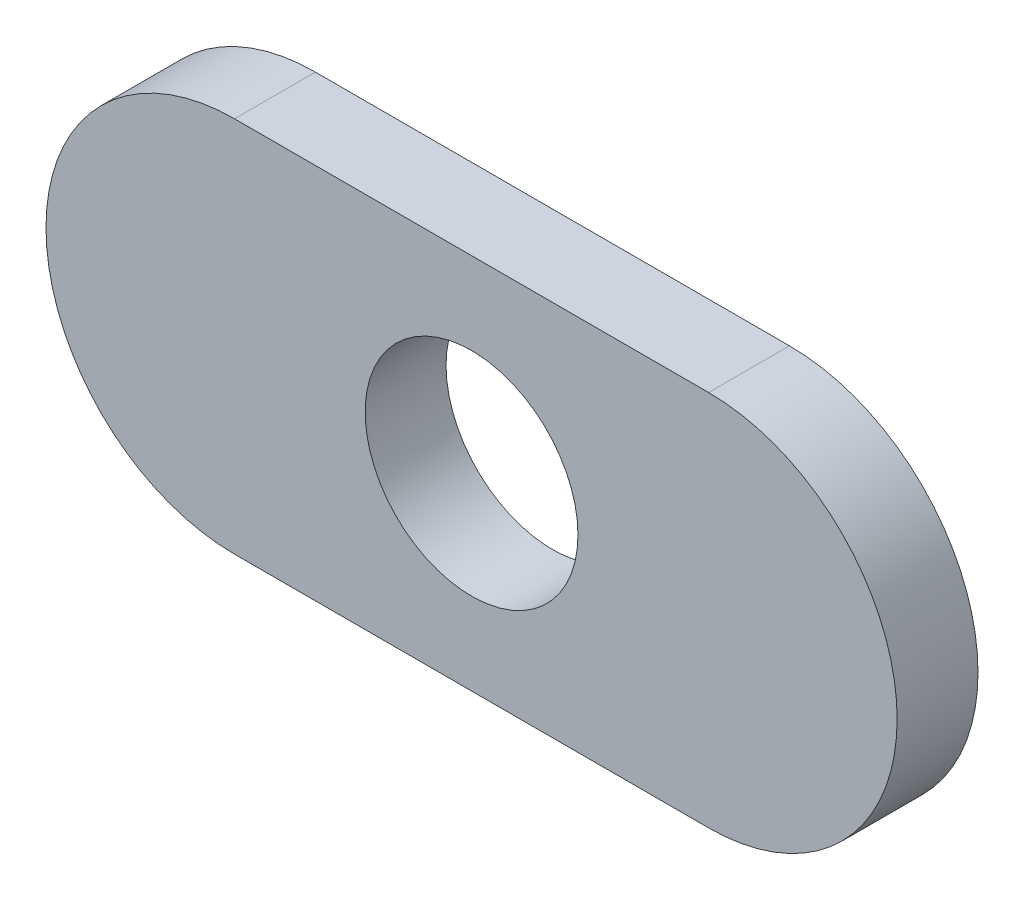
ISO-10303-21;
HEADER;
FILE_DESCRIPTION(('STEP AP214'),'2;1');
FILE_NAME('part.step','',(''),(''),'','','');
FILE_SCHEMA(('AUTOMOTIVE_DESIGN { 1 0 10303 214 1 1 1 1 }'));
ENDSEC;
DATA;
#1=APPLICATION_CONTEXT('core data for automotive mechanical design processes');
#2=APPLICATION_PROTOCOL_DEFINITION('international standard','automotive_design',2000,#1);
#3=PRODUCT_CONTEXT('',#1,'mechanical');
#4=PRODUCT('Part','Part','',(#3));
#5=PRODUCT_RELATED_PRODUCT_CATEGORY('part','',(#4));
#6=PRODUCT_DEFINITION_FORMATION('','',#4);
#7=PRODUCT_DEFINITION_CONTEXT('part definition',#1,'design');
#8=PRODUCT_DEFINITION('design','',#6,#7);
#9=PRODUCT_DEFINITION_SHAPE('','',#8);
#10=(LENGTH_UNIT() NAMED_UNIT(*) SI_UNIT(.MILLI.,.METRE.));
#11=(NAMED_UNIT(*) PLANE_ANGLE_UNIT() SI_UNIT($,.RADIAN.));
#12=(NAMED_UNIT(*) SI_UNIT($,.STERADIAN.) SOLID_ANGLE_UNIT());
#13=UNCERTAINTY_MEASURE_WITH_UNIT(LENGTH_MEASURE(1.E-05),#10,'distance_accuracy_value','');
#14=(GEOMETRIC_REPRESENTATION_CONTEXT(3) GLOBAL_UNCERTAINTY_ASSIGNED_CONTEXT((#13)) GLOBAL_UNIT_ASSIGNED_CONTEXT((#10,
#11,#12)) REPRESENTATION_CONTEXT('',''));
#15=CARTESIAN_POINT('',(0.,0.,0.));
#16=DIRECTION('',(0.,0.,1.));
#17=DIRECTION('',(1.,0.,0.));
#18=AXIS2_PLACEMENT_3D('',#15,#16,#17);
#19=CARTESIAN_POINT('',(111.278662660247,125.933065895994,2.413));
#20=DIRECTION('',(0.,0.,-1.));
#21=DIRECTION('',(-1.,0.,0.));
#22=AXIS2_PLACEMENT_3D('',#19,#20,#21);
#23=CYLINDRICAL_SURFACE('',#22,5.62609999999999);
#24=CARTESIAN_POINT('',(111.278662660247,125.933065895994,0.));
#25=DIRECTION('',(0.,0.,1.));
#26=DIRECTION('',(-1.,0.,0.));
#27=AXIS2_PLACEMENT_3D('',#24,#25,#26);
#28=CIRCLE('',#27,5.62609999999999);
#29=CARTESIAN_POINT('',(111.278662660247,131.559165895994,0.));
#30=VERTEX_POINT('',#29);
#31=CARTESIAN_POINT('',(111.278662660247,120.306965895994,0.));
#32=VERTEX_POINT('',#31);
#33=EDGE_CURVE('E95',#30,#32,#28,.T.);
#34=ORIENTED_EDGE('',*,*,#33,.T.);
#35=DIRECTION('',(0.,0.,-1.));
#36=VECTOR('',#35,1.);
#37=CARTESIAN_POINT('',(111.278662660247,120.306965895994,2.413));
#38=LINE('',#37,#36);
#39=CARTESIAN_POINT('',(111.278662660247,120.306965895994,2.413));
#40=VERTEX_POINT('',#39);
#41=EDGE_CURVE('E11',#40,#32,#38,.T.);
#42=ORIENTED_EDGE('',*,*,#41,.F.);
#43=CARTESIAN_POINT('',(111.278662660247,125.933065895994,2.413));
#44=DIRECTION('',(0.,0.,1.));
#45=DIRECTION('',(-1.,0.,0.));
#46=AXIS2_PLACEMENT_3D('',#43,#44,#45);
#47=CIRCLE('',#46,5.62609999999999);
#48=CARTESIAN_POINT('',(111.278662660247,131.559165895994,2.413));
#49=VERTEX_POINT('',#48);
#50=EDGE_CURVE('E83',#49,#40,#47,.T.);
#51=ORIENTED_EDGE('',*,*,#50,.F.);
#52=DIRECTION('',(0.,0.,-1.));
#53=VECTOR('',#52,1.);
#54=CARTESIAN_POINT('',(111.278662660247,131.559165895994,2.413));
#55=LINE('',#54,#53);
#56=EDGE_CURVE('E91',#49,#30,#55,.T.);
#57=ORIENTED_EDGE('',*,*,#56,.T.);
#58=EDGE_LOOP('',(#34,#42,#51,#57));
#59=FACE_BOUND('',#58,.T.);
#60=ADVANCED_FACE('F32',(#59),#23,.T.);
#61=CARTESIAN_POINT('',(111.278662660247,120.306965895994,2.413));
#62=DIRECTION('',(0.,1.,0.));
#63=DIRECTION('',(0.,0.,1.));
#64=AXIS2_PLACEMENT_3D('',#61,#62,#63);
#65=PLANE('',#64);
#66=DIRECTION('',(1.,0.,0.));
#67=VECTOR('',#66,1.);
#68=CARTESIAN_POINT('',(111.278662660247,120.306965895994,0.));
#69=LINE('',#68,#67);
#70=CARTESIAN_POINT('',(125.426462660247,120.306965895994,0.));
#71=VERTEX_POINT('',#70);
#72=EDGE_CURVE('E87',#32,#71,#69,.T.);
#73=ORIENTED_EDGE('',*,*,#72,.T.);
#74=DIRECTION('',(0.,0.,-1.));
#75=VECTOR('',#74,1.);
#76=CARTESIAN_POINT('',(125.426462660247,120.306965895994,2.413));
#77=LINE('',#76,#75);
#78=CARTESIAN_POINT('',(125.426462660247,120.306965895994,2.413));
#79=VERTEX_POINT('',#78);
#80=EDGE_CURVE('E40',#79,#71,#77,.T.);
#81=ORIENTED_EDGE('',*,*,#80,.F.);
#82=DIRECTION('',(1.,0.,0.));
#83=VECTOR('',#82,1.);
#84=CARTESIAN_POINT('',(111.278662660247,120.306965895994,2.413));
#85=LINE('',#84,#83);
#86=EDGE_CURVE('E78',#40,#79,#85,.T.);
#87=ORIENTED_EDGE('',*,*,#86,.F.);
#88=ORIENTED_EDGE('',*,*,#41,.T.);
#89=EDGE_LOOP('',(#73,#81,#87,#88));
#90=FACE_BOUND('',#89,.T.);
#91=ADVANCED_FACE('F86',(#90),#65,.F.);
#92=CARTESIAN_POINT('',(125.426462660247,125.933065895994,2.413));
#93=DIRECTION('',(0.,0.,-1.));
#94=DIRECTION('',(-1.,0.,0.));
#95=AXIS2_PLACEMENT_3D('',#92,#93,#94);
#96=CYLINDRICAL_SURFACE('',#95,5.62609999999999);
#97=CARTESIAN_POINT('',(125.426462660247,125.933065895994,0.));
#98=DIRECTION('',(0.,0.,1.));
#99=DIRECTION('',(1.,0.,0.));
#100=AXIS2_PLACEMENT_3D('',#97,#98,#99);
#101=CIRCLE('',#100,5.62609999999999);
#102=CARTESIAN_POINT('',(125.426462660247,131.559165895994,0.));
#103=VERTEX_POINT('',#102);
#104=EDGE_CURVE('E65',#71,#103,#101,.T.);
#105=ORIENTED_EDGE('',*,*,#104,.T.);
#106=DIRECTION('',(0.,0.,-1.));
#107=VECTOR('',#106,1.);
#108=CARTESIAN_POINT('',(125.426462660247,131.559165895994,2.413));
#109=LINE('',#108,#107);
#110=CARTESIAN_POINT('',(125.426462660247,131.559165895994,2.413));
#111=VERTEX_POINT('',#110);
#112=EDGE_CURVE('E88',#111,#103,#109,.T.);
#113=ORIENTED_EDGE('',*,*,#112,.F.);
#114=CARTESIAN_POINT('',(125.426462660247,125.933065895994,2.413));
#115=DIRECTION('',(0.,0.,1.));
#116=DIRECTION('',(1.,0.,0.));
#117=AXIS2_PLACEMENT_3D('',#114,#115,#116);
#118=CIRCLE('',#117,5.62609999999999);
#119=EDGE_CURVE('E81',#79,#111,#118,.T.);
#120=ORIENTED_EDGE('',*,*,#119,.F.);
#121=ORIENTED_EDGE('',*,*,#80,.T.);
#122=EDGE_LOOP('',(#105,#113,#120,#121));
#123=FACE_BOUND('',#122,.T.);
#124=ADVANCED_FACE('F89',(#123),#96,.T.);
#125=CARTESIAN_POINT('',(111.278662660247,131.559165895994,2.413));
#126=DIRECTION('',(0.,-1.,0.));
#127=DIRECTION('',(0.,0.,-1.));
#128=AXIS2_PLACEMENT_3D('',#125,#126,#127);
#129=PLANE('',#128);
#130=DIRECTION('',(-1.,0.,0.));
#131=VECTOR('',#130,1.);
#132=CARTESIAN_POINT('',(111.278662660247,131.559165895994,0.));
#133=LINE('',#132,#131);
#134=EDGE_CURVE('E71',#103,#30,#133,.T.);
#135=ORIENTED_EDGE('',*,*,#134,.T.);
#136=ORIENTED_EDGE('',*,*,#56,.F.);
#137=DIRECTION('',(-1.,0.,0.));
#138=VECTOR('',#137,1.);
#139=CARTESIAN_POINT('',(111.278662660247,131.559165895994,2.413));
#140=LINE('',#139,#138);
#141=EDGE_CURVE('E48',#111,#49,#140,.T.);
#142=ORIENTED_EDGE('',*,*,#141,.F.);
#143=ORIENTED_EDGE('',*,*,#112,.T.);
#144=EDGE_LOOP('',(#135,#136,#142,#143));
#145=FACE_BOUND('',#144,.T.);
#146=ADVANCED_FACE('F103',(#145),#129,.F.);
#147=CARTESIAN_POINT('',(111.278662660247,125.933065895994,2.413));
#148=DIRECTION('',(0.,0.,-1.));
#149=DIRECTION('',(-1.,0.,0.));
#150=AXIS2_PLACEMENT_3D('',#147,#148,#149);
#151=PLANE('',#150);
#152=CARTESIAN_POINT('',(118.352562660247,125.933065895994,2.413));
#153=DIRECTION('',(0.,0.,1.));
#154=DIRECTION('',(1.,0.,0.));
#155=AXIS2_PLACEMENT_3D('',#152,#153,#154);
#156=CIRCLE('',#155,3.175);
#157=CARTESIAN_POINT('',(121.527562660247,125.933065895994,2.413));
#158=VERTEX_POINT('',#157);
#159=EDGE_CURVE('E98',#158,#158,#156,.T.);
#160=ORIENTED_EDGE('',*,*,#159,.F.);
#161=EDGE_LOOP('',(#160));
#162=FACE_BOUND('',#161,.T.);
#163=ORIENTED_EDGE('',*,*,#50,.T.);
#164=ORIENTED_EDGE('',*,*,#86,.T.);
#165=ORIENTED_EDGE('',*,*,#119,.T.);
#166=ORIENTED_EDGE('',*,*,#141,.T.);
#167=EDGE_LOOP('',(#163,#164,#165,#166));
#168=FACE_BOUND('',#167,.T.);
#169=ADVANCED_FACE('F79',(#162,#168),#151,.F.);
#170=CARTESIAN_POINT('',(111.278662660247,125.933065895994,0.));
#171=DIRECTION('',(0.,0.,-1.));
#172=DIRECTION('',(-1.,0.,0.));
#173=AXIS2_PLACEMENT_3D('',#170,#171,#172);
#174=PLANE('',#173);
#175=CARTESIAN_POINT('',(118.352562660247,125.933065895994,0.));
#176=DIRECTION('',(0.,0.,-1.));
#177=DIRECTION('',(-1.,0.,0.));
#178=AXIS2_PLACEMENT_3D('',#175,#176,#177);
#179=CIRCLE('',#178,3.175);
#180=CARTESIAN_POINT('',(115.177562660247,125.933065895994,0.));
#181=VERTEX_POINT('',#180);
#182=EDGE_CURVE('E109',#181,#181,#179,.F.);
#183=ORIENTED_EDGE('',*,*,#182,.T.);
#184=EDGE_LOOP('',(#183));
#185=FACE_BOUND('',#184,.T.);
#186=ORIENTED_EDGE('',*,*,#33,.F.);
#187=ORIENTED_EDGE('',*,*,#134,.F.);
#188=ORIENTED_EDGE('',*,*,#104,.F.);
#189=ORIENTED_EDGE('',*,*,#72,.F.);
#190=EDGE_LOOP('',(#186,#187,#188,#189));
#191=FACE_BOUND('',#190,.T.);
#192=ADVANCED_FACE('F106',(#185,#191),#174,.T.);
#193=CARTESIAN_POINT('',(118.352562660247,125.933065895994,-0.00100000000000013));
#194=DIRECTION('',(0.,0.,1.));
#195=DIRECTION('',(1.,0.,0.));
#196=AXIS2_PLACEMENT_3D('',#193,#194,#195);
#197=CYLINDRICAL_SURFACE('',#196,3.175);
#198=ORIENTED_EDGE('',*,*,#182,.F.);
#199=EDGE_LOOP('',(#198));
#200=FACE_BOUND('',#199,.T.);
#201=ORIENTED_EDGE('',*,*,#159,.T.);
#202=EDGE_LOOP('',(#201));
#203=FACE_BOUND('',#202,.T.);
#204=ADVANCED_FACE('F115',(#200,#203),#197,.F.);
#205=CLOSED_SHELL('',(#60,#91,#124,#146,#169,#192,#204));
#206=MANIFOLD_SOLID_BREP('B2',#205);
#207=ADVANCED_BREP_SHAPE_REPRESENTATION('',(#18,#206),#14);
#208=SHAPE_DEFINITION_REPRESENTATION(#9,#207);
ENDSEC;
END-ISO-10303-21;
